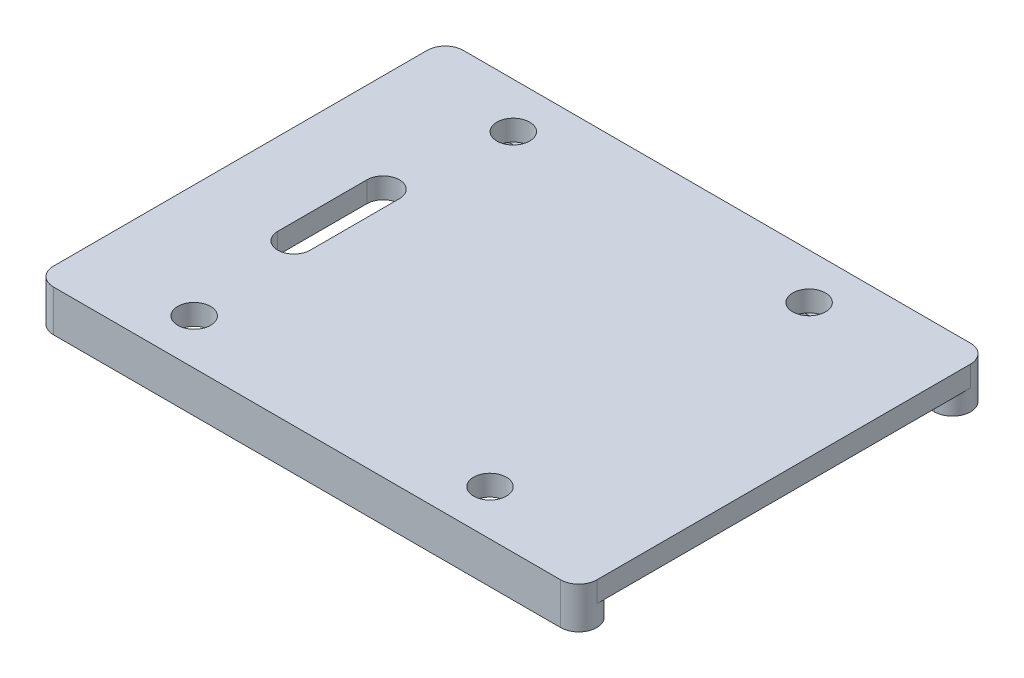
ISO-10303-21;
HEADER;
FILE_DESCRIPTION(('STEP AP214'),'2;1');
FILE_NAME('part.step','',(''),(''),'','','');
FILE_SCHEMA(('AUTOMOTIVE_DESIGN { 1 0 10303 214 1 1 1 1 }'));
ENDSEC;
DATA;
#1=APPLICATION_CONTEXT('core data for automotive mechanical design processes');
#2=APPLICATION_PROTOCOL_DEFINITION('international standard','automotive_design',2000,#1);
#3=PRODUCT_CONTEXT('',#1,'mechanical');
#4=PRODUCT('Part','Part','',(#3));
#5=PRODUCT_RELATED_PRODUCT_CATEGORY('part','',(#4));
#6=PRODUCT_DEFINITION_FORMATION('','',#4);
#7=PRODUCT_DEFINITION_CONTEXT('part definition',#1,'design');
#8=PRODUCT_DEFINITION('design','',#6,#7);
#9=PRODUCT_DEFINITION_SHAPE('','',#8);
#10=(LENGTH_UNIT() NAMED_UNIT(*) SI_UNIT(.MILLI.,.METRE.));
#11=(NAMED_UNIT(*) PLANE_ANGLE_UNIT() SI_UNIT($,.RADIAN.));
#12=(NAMED_UNIT(*) SI_UNIT($,.STERADIAN.) SOLID_ANGLE_UNIT());
#13=UNCERTAINTY_MEASURE_WITH_UNIT(LENGTH_MEASURE(1.E-05),#10,'distance_accuracy_value','');
#14=(GEOMETRIC_REPRESENTATION_CONTEXT(3) GLOBAL_UNCERTAINTY_ASSIGNED_CONTEXT((#13)) GLOBAL_UNIT_ASSIGNED_CONTEXT((#10,
#11,#12)) REPRESENTATION_CONTEXT('',''));
#15=CARTESIAN_POINT('',(0.,0.,0.));
#16=DIRECTION('',(0.,0.,1.));
#17=DIRECTION('',(1.,0.,0.));
#18=AXIS2_PLACEMENT_3D('',#15,#16,#17);
#19=CARTESIAN_POINT('',(-22.9969645109202,-35.5257770331973,-3.90079332186036));
#20=DIRECTION('',(0.,1.,0.));
#21=DIRECTION('',(-1.,0.,0.));
#22=AXIS2_PLACEMENT_3D('',#19,#20,#21);
#23=CYLINDRICAL_SURFACE('',#22,1.74329172099651);
#24=CARTESIAN_POINT('',(-22.9969645109202,17.0764824763644,-3.90079332186036));
#25=DIRECTION('',(0.,1.,0.));
#26=DIRECTION('',(-1.,0.,0.));
#27=AXIS2_PLACEMENT_3D('',#24,#25,#26);
#28=CIRCLE('',#27,1.74329172099651);
#29=CARTESIAN_POINT('',(-22.9969645109202,17.0764824763644,-2.15750160086384));
#30=VERTEX_POINT('',#29);
#31=CARTESIAN_POINT('',(-22.9969645109202,17.0764824763644,-5.64408504285687));
#32=VERTEX_POINT('',#31);
#33=EDGE_CURVE('E47',#30,#32,#28,.F.);
#34=ORIENTED_EDGE('',*,*,#33,.F.);
#35=DIRECTION('',(0.,1.,0.));
#36=VECTOR('',#35,1.);
#37=CARTESIAN_POINT('',(-22.9969645109202,-35.5257770331973,-2.15750160086384));
#38=LINE('',#37,#36);
#39=CARTESIAN_POINT('',(-22.9969645109202,19.0764824763644,-2.15750160086384));
#40=VERTEX_POINT('',#39);
#41=EDGE_CURVE('E311',#30,#40,#38,.T.);
#42=ORIENTED_EDGE('',*,*,#41,.T.);
#43=CARTESIAN_POINT('',(-22.9969645109202,19.0764824763644,-3.90079332186036));
#44=DIRECTION('',(0.,1.,0.));
#45=DIRECTION('',(1.,0.,0.));
#46=AXIS2_PLACEMENT_3D('',#43,#44,#45);
#47=CIRCLE('',#46,1.74329172099651);
#48=CARTESIAN_POINT('',(-24.7402562319167,19.0764824763644,-3.90079332186036));
#49=VERTEX_POINT('',#48);
#50=EDGE_CURVE('E281',#49,#40,#47,.T.);
#51=ORIENTED_EDGE('',*,*,#50,.F.);
#52=DIRECTION('',(0.,-1.,0.));
#53=VECTOR('',#52,1.);
#54=CARTESIAN_POINT('',(-24.7402562319167,21.0764824763644,-3.90079332186036));
#55=LINE('',#54,#53);
#56=CARTESIAN_POINT('',(-24.7402562319167,21.0764824763644,-3.90079332186036));
#57=VERTEX_POINT('',#56);
#58=EDGE_CURVE('E291',#57,#49,#55,.T.);
#59=ORIENTED_EDGE('',*,*,#58,.F.);
#60=CARTESIAN_POINT('',(-22.9969645109202,21.0764824763644,-3.90079332186036));
#61=DIRECTION('',(0.,1.,0.));
#62=DIRECTION('',(-1.,0.,0.));
#63=AXIS2_PLACEMENT_3D('',#60,#61,#62);
#64=CIRCLE('',#63,1.74329172099651);
#65=CARTESIAN_POINT('',(-22.9969645109202,21.0764824763644,-5.64408504285687));
#66=VERTEX_POINT('',#65);
#67=EDGE_CURVE('E233',#66,#57,#64,.T.);
#68=ORIENTED_EDGE('',*,*,#67,.F.);
#69=DIRECTION('',(0.,1.,0.));
#70=VECTOR('',#69,1.);
#71=CARTESIAN_POINT('',(-22.9969645109202,-35.5257770331973,-5.64408504285687));
#72=LINE('',#71,#70);
#73=EDGE_CURVE('E299',#32,#66,#72,.T.);
#74=ORIENTED_EDGE('',*,*,#73,.F.);
#75=EDGE_LOOP('',(#34,#42,#51,#59,#68,#74));
#76=FACE_BOUND('',#75,.T.);
#77=ADVANCED_FACE('F40',(#76),#23,.T.);
#78=CARTESIAN_POINT('',(-22.9969645109202,-35.5257770331973,-5.64408504285687));
#79=DIRECTION('',(0.,0.,-1.));
#80=DIRECTION('',(0.,1.,0.));
#81=AXIS2_PLACEMENT_3D('',#78,#79,#80);
#82=PLANE('',#81);
#83=DIRECTION('',(1.,0.,0.));
#84=VECTOR('',#83,1.);
#85=CARTESIAN_POINT('',(-22.9969645109202,17.0764824763644,-5.64408504285687));
#86=LINE('',#85,#84);
#87=CARTESIAN_POINT('',(26.0030354890798,17.0764824763644,-5.64408504285687));
#88=VERTEX_POINT('',#87);
#89=EDGE_CURVE('E298',#32,#88,#86,.T.);
#90=ORIENTED_EDGE('',*,*,#89,.F.);
#91=ORIENTED_EDGE('',*,*,#73,.T.);
#92=DIRECTION('',(-1.,0.,0.));
#93=VECTOR('',#92,1.);
#94=CARTESIAN_POINT('',(0.,21.0764824763644,-5.64408504285687));
#95=LINE('',#94,#93);
#96=CARTESIAN_POINT('',(26.0030354890798,21.0764824763644,-5.64408504285687));
#97=VERTEX_POINT('',#96);
#98=EDGE_CURVE('E230',#97,#66,#95,.T.);
#99=ORIENTED_EDGE('',*,*,#98,.F.);
#100=DIRECTION('',(0.,1.,0.));
#101=VECTOR('',#100,1.);
#102=CARTESIAN_POINT('',(26.0030354890798,-35.5257770331973,-5.64408504285687));
#103=LINE('',#102,#101);
#104=EDGE_CURVE('E313',#88,#97,#103,.T.);
#105=ORIENTED_EDGE('',*,*,#104,.F.);
#106=EDGE_LOOP('',(#90,#91,#99,#105));
#107=FACE_BOUND('',#106,.T.);
#108=ADVANCED_FACE('F351',(#107),#82,.T.);
#109=CARTESIAN_POINT('',(26.0030354890798,-35.5257770331973,-3.90079332186036));
#110=DIRECTION('',(0.,1.,0.));
#111=DIRECTION('',(-1.,0.,0.));
#112=AXIS2_PLACEMENT_3D('',#109,#110,#111);
#113=CYLINDRICAL_SURFACE('',#112,1.74329172099651);
#114=CARTESIAN_POINT('',(26.0030354890798,17.0764824763644,-3.90079332186036));
#115=DIRECTION('',(0.,1.,0.));
#116=DIRECTION('',(-1.,0.,0.));
#117=AXIS2_PLACEMENT_3D('',#114,#115,#116);
#118=CIRCLE('',#117,1.74329172099651);
#119=CARTESIAN_POINT('',(26.0030354890798,17.0764824763644,-2.15750160086386));
#120=VERTEX_POINT('',#119);
#121=EDGE_CURVE('E296',#88,#120,#118,.F.);
#122=ORIENTED_EDGE('',*,*,#121,.F.);
#123=ORIENTED_EDGE('',*,*,#104,.T.);
#124=CARTESIAN_POINT('',(26.0030354890798,21.0764824763644,-3.90079332186036));
#125=DIRECTION('',(0.,1.,0.));
#126=DIRECTION('',(-1.,0.,0.));
#127=AXIS2_PLACEMENT_3D('',#124,#125,#126);
#128=CIRCLE('',#127,1.74329172099651);
#129=CARTESIAN_POINT('',(27.7463272100763,21.0764824763644,-3.90079332186036));
#130=VERTEX_POINT('',#129);
#131=EDGE_CURVE('E226',#130,#97,#128,.T.);
#132=ORIENTED_EDGE('',*,*,#131,.F.);
#133=DIRECTION('',(0.,-1.,0.));
#134=VECTOR('',#133,1.);
#135=CARTESIAN_POINT('',(27.7463272100763,21.0764824763644,-3.90079332186036));
#136=LINE('',#135,#134);
#137=CARTESIAN_POINT('',(27.7463272100763,19.0764824763644,-3.90079332186036));
#138=VERTEX_POINT('',#137);
#139=EDGE_CURVE('E275',#130,#138,#136,.T.);
#140=ORIENTED_EDGE('',*,*,#139,.T.);
#141=CARTESIAN_POINT('',(26.0030354890798,19.0764824763644,-3.90079332186036));
#142=DIRECTION('',(0.,1.,0.));
#143=DIRECTION('',(1.,0.,0.));
#144=AXIS2_PLACEMENT_3D('',#141,#142,#143);
#145=CIRCLE('',#144,1.74329172099651);
#146=CARTESIAN_POINT('',(26.0030354890798,19.0764824763644,-2.15750160086386));
#147=VERTEX_POINT('',#146);
#148=EDGE_CURVE('E308',#147,#138,#145,.T.);
#149=ORIENTED_EDGE('',*,*,#148,.F.);
#150=DIRECTION('',(0.,1.,0.));
#151=VECTOR('',#150,1.);
#152=CARTESIAN_POINT('',(26.0030354890798,-35.5257770331973,-2.15750160086386));
#153=LINE('',#152,#151);
#154=EDGE_CURVE('E315',#120,#147,#153,.T.);
#155=ORIENTED_EDGE('',*,*,#154,.F.);
#156=EDGE_LOOP('',(#122,#123,#132,#140,#149,#155));
#157=FACE_BOUND('',#156,.T.);
#158=ADVANCED_FACE('F358',(#157),#113,.T.);
#159=CARTESIAN_POINT('',(26.0030354890798,-35.5257770331973,-2.15750160086386));
#160=DIRECTION('',(0.,0.,1.));
#161=DIRECTION('',(1.,0.,0.));
#162=AXIS2_PLACEMENT_3D('',#159,#160,#161);
#163=PLANE('',#162);
#164=DIRECTION('',(-1.,0.,0.));
#165=VECTOR('',#164,1.);
#166=CARTESIAN_POINT('',(26.0030354890798,17.0764824763644,-2.15750160086386));
#167=LINE('',#166,#165);
#168=EDGE_CURVE('E11',#120,#30,#167,.T.);
#169=ORIENTED_EDGE('',*,*,#168,.F.);
#170=ORIENTED_EDGE('',*,*,#154,.T.);
#171=DIRECTION('',(1.,0.,0.));
#172=VECTOR('',#171,1.);
#173=CARTESIAN_POINT('',(26.0030354890798,19.0764824763644,-2.15750160086386));
#174=LINE('',#173,#172);
#175=CARTESIAN_POINT('',(16.1016908515182,19.0764824763644,-2.15750160086386));
#176=VERTEX_POINT('',#175);
#177=EDGE_CURVE('E304',#176,#147,#174,.T.);
#178=ORIENTED_EDGE('',*,*,#177,.F.);
#179=CARTESIAN_POINT('',(13.4793801266414,19.0764824763644,-2.15750160086385));
#180=VERTEX_POINT('',#179);
#181=EDGE_CURVE('E363',#180,#176,#174,.T.);
#182=ORIENTED_EDGE('',*,*,#181,.F.);
#183=CARTESIAN_POINT('',(-12.4733091484818,19.0764824763644,-2.15750160086385));
#184=VERTEX_POINT('',#183);
#185=EDGE_CURVE('E366',#184,#180,#174,.T.);
#186=ORIENTED_EDGE('',*,*,#185,.F.);
#187=CARTESIAN_POINT('',(-15.0956198733586,19.0764824763644,-2.15750160086385));
#188=VERTEX_POINT('',#187);
#189=EDGE_CURVE('E309',#188,#184,#174,.T.);
#190=ORIENTED_EDGE('',*,*,#189,.F.);
#191=EDGE_CURVE('E305',#40,#188,#174,.T.);
#192=ORIENTED_EDGE('',*,*,#191,.F.);
#193=ORIENTED_EDGE('',*,*,#41,.F.);
#194=EDGE_LOOP('',(#169,#170,#178,#182,#186,#190,#192,#193));
#195=FACE_BOUND('',#194,.T.);
#196=ADVANCED_FACE('F326',(#195),#163,.T.);
#197=CARTESIAN_POINT('',(94.2357775993267,17.0764824763644,-11.0499999999999));
#198=DIRECTION('',(0.,1.,0.));
#199=DIRECTION('',(-1.,0.,0.));
#200=AXIS2_PLACEMENT_3D('',#197,#198,#199);
#201=PLANE('',#200);
#202=ORIENTED_EDGE('',*,*,#33,.T.);
#203=ORIENTED_EDGE('',*,*,#89,.T.);
#204=ORIENTED_EDGE('',*,*,#121,.T.);
#205=ORIENTED_EDGE('',*,*,#168,.T.);
#206=EDGE_LOOP('',(#202,#203,#204,#205));
#207=FACE_BOUND('',#206,.T.);
#208=ADVANCED_FACE('F355',(#207),#201,.F.);
#209=CARTESIAN_POINT('',(0.,19.0764824763644,0.));
#210=DIRECTION('',(0.,1.,0.));
#211=DIRECTION('',(-1.,0.,0.));
#212=AXIS2_PLACEMENT_3D('',#209,#210,#211);
#213=PLANE('',#212);
#214=DIRECTION('',(-1.,0.,0.));
#215=VECTOR('',#214,1.);
#216=CARTESIAN_POINT('',(26.0030354890798,19.0764824763644,30.4567082790035));
#217=LINE('',#216,#215);
#218=CARTESIAN_POINT('',(13.4788389526196,19.0764824763644,30.4567082790035));
#219=VERTEX_POINT('',#218);
#220=CARTESIAN_POINT('',(-12.47276797446,19.0764824763644,30.4567082790035));
#221=VERTEX_POINT('',#220);
#222=EDGE_CURVE('E184',#219,#221,#217,.T.);
#223=ORIENTED_EDGE('',*,*,#222,.T.);
#224=CARTESIAN_POINT('',(-13.7844645109202,19.0764824763644,29.5625));
#225=DIRECTION('',(0.,1.,0.));
#226=DIRECTION('',(-1.,0.,0.));
#227=AXIS2_PLACEMENT_3D('',#224,#225,#226);
#228=CIRCLE('',#227,1.5875);
#229=CARTESIAN_POINT('',(-15.0961610473803,19.0764824763644,30.4567082790035));
#230=VERTEX_POINT('',#229);
#231=EDGE_CURVE('E716',#221,#230,#228,.T.);
#232=ORIENTED_EDGE('',*,*,#231,.T.);
#233=CARTESIAN_POINT('',(-22.9969645109202,19.0764824763644,30.4567082790035));
#234=VERTEX_POINT('',#233);
#235=EDGE_CURVE('E205',#230,#234,#217,.T.);
#236=ORIENTED_EDGE('',*,*,#235,.T.);
#237=CARTESIAN_POINT('',(-22.9969645109202,19.0764824763644,32.2000000000001));
#238=DIRECTION('',(0.,1.,0.));
#239=DIRECTION('',(-1.,0.,0.));
#240=AXIS2_PLACEMENT_3D('',#237,#238,#239);
#241=CIRCLE('',#240,1.74329172099651);
#242=CARTESIAN_POINT('',(-24.7402562319167,19.0764824763644,32.2000000000001));
#243=VERTEX_POINT('',#242);
#244=EDGE_CURVE('E209',#234,#243,#241,.T.);
#245=ORIENTED_EDGE('',*,*,#244,.T.);
#246=DIRECTION('',(0.,0.,1.));
#247=VECTOR('',#246,1.);
#248=CARTESIAN_POINT('',(-24.7402562319167,19.0764824763644,0.));
#249=LINE('',#248,#247);
#250=EDGE_CURVE('E258',#49,#243,#249,.T.);
#251=ORIENTED_EDGE('',*,*,#250,.F.);
#252=ORIENTED_EDGE('',*,*,#50,.T.);
#253=ORIENTED_EDGE('',*,*,#191,.T.);
#254=CARTESIAN_POINT('',(-13.7844645109202,19.0764824763644,-1.26249999999993));
#255=DIRECTION('',(0.,1.,0.));
#256=DIRECTION('',(-1.,0.,0.));
#257=AXIS2_PLACEMENT_3D('',#254,#255,#256);
#258=CIRCLE('',#257,1.5875);
#259=EDGE_CURVE('E370',#188,#184,#258,.T.);
#260=ORIENTED_EDGE('',*,*,#259,.T.);
#261=ORIENTED_EDGE('',*,*,#185,.T.);
#262=CARTESIAN_POINT('',(14.7905354890798,19.0764824763644,-1.26249999999992));
#263=DIRECTION('',(0.,1.,0.));
#264=DIRECTION('',(-1.,0.,0.));
#265=AXIS2_PLACEMENT_3D('',#262,#263,#264);
#266=CIRCLE('',#265,1.5875);
#267=EDGE_CURVE('E707',#180,#176,#266,.T.);
#268=ORIENTED_EDGE('',*,*,#267,.T.);
#269=ORIENTED_EDGE('',*,*,#177,.T.);
#270=ORIENTED_EDGE('',*,*,#148,.T.);
#271=DIRECTION('',(0.,0.,1.));
#272=VECTOR('',#271,1.);
#273=CARTESIAN_POINT('',(27.7463272100763,19.0764824763644,0.));
#274=LINE('',#273,#272);
#275=CARTESIAN_POINT('',(27.7463272100763,19.0764824763644,32.2000000000001));
#276=VERTEX_POINT('',#275);
#277=EDGE_CURVE('E212',#138,#276,#274,.T.);
#278=ORIENTED_EDGE('',*,*,#277,.T.);
#279=CARTESIAN_POINT('',(26.0030354890798,19.0764824763644,32.2000000000001));
#280=DIRECTION('',(0.,1.,0.));
#281=DIRECTION('',(-1.,0.,0.));
#282=AXIS2_PLACEMENT_3D('',#279,#280,#281);
#283=CIRCLE('',#282,1.74329172099651);
#284=CARTESIAN_POINT('',(26.0030354890798,19.0764824763644,30.4567082790035));
#285=VERTEX_POINT('',#284);
#286=EDGE_CURVE('E208',#276,#285,#283,.T.);
#287=ORIENTED_EDGE('',*,*,#286,.T.);
#288=CARTESIAN_POINT('',(16.10223202554,19.0764824763644,30.4567082790035));
#289=VERTEX_POINT('',#288);
#290=EDGE_CURVE('E183',#285,#289,#217,.T.);
#291=ORIENTED_EDGE('',*,*,#290,.T.);
#292=CARTESIAN_POINT('',(14.7905354890798,19.0764824763644,29.5625));
#293=DIRECTION('',(0.,1.,0.));
#294=DIRECTION('',(-1.,0.,0.));
#295=AXIS2_PLACEMENT_3D('',#292,#293,#294);
#296=CIRCLE('',#295,1.58750000000005);
#297=EDGE_CURVE('E190',#289,#219,#296,.T.);
#298=ORIENTED_EDGE('',*,*,#297,.T.);
#299=EDGE_LOOP('',(#223,#232,#236,#245,#251,#252,#253,#260,#261,#268,#269,#270,#278,#287,#291,#298));
#300=FACE_BOUND('',#299,.T.);
#301=CARTESIAN_POINT('',(-15.2469645109202,19.0764824763644,9.84000000000006));
#302=DIRECTION('',(0.,1.,0.));
#303=DIRECTION('',(-1.,0.,0.));
#304=AXIS2_PLACEMENT_3D('',#301,#302,#303);
#305=CIRCLE('',#304,1.57420798390938);
#306=CARTESIAN_POINT('',(-13.6727565270109,19.0764824763644,9.84000000000004));
#307=VERTEX_POINT('',#306);
#308=CARTESIAN_POINT('',(-16.8211724948296,19.0764824763644,9.84000000000007));
#309=VERTEX_POINT('',#308);
#310=EDGE_CURVE('E261',#307,#309,#305,.T.);
#311=ORIENTED_EDGE('',*,*,#310,.T.);
#312=DIRECTION('',(0.,0.,1.));
#313=VECTOR('',#312,1.);
#314=CARTESIAN_POINT('',(-16.8211724948297,19.0764824763644,1.42176737639203E-13));
#315=LINE('',#314,#313);
#316=CARTESIAN_POINT('',(-16.8211724948296,19.0764824763644,18.4600000000001));
#317=VERTEX_POINT('',#316);
#318=EDGE_CURVE('E227',#309,#317,#315,.T.);
#319=ORIENTED_EDGE('',*,*,#318,.T.);
#320=CARTESIAN_POINT('',(-15.2469645109202,19.0764824763644,18.4600000000001));
#321=DIRECTION('',(0.,1.,0.));
#322=DIRECTION('',(-1.,0.,0.));
#323=AXIS2_PLACEMENT_3D('',#320,#321,#322);
#324=CIRCLE('',#323,1.57420798390938);
#325=CARTESIAN_POINT('',(-13.6727565270108,19.0764824763644,18.4600000000001));
#326=VERTEX_POINT('',#325);
#327=EDGE_CURVE('E267',#317,#326,#324,.T.);
#328=ORIENTED_EDGE('',*,*,#327,.T.);
#329=DIRECTION('',(0.,0.,-1.));
#330=VECTOR('',#329,1.);
#331=CARTESIAN_POINT('',(-13.6727565270109,19.0764824763644,1.1281398154032E-13));
#332=LINE('',#331,#330);
#333=EDGE_CURVE('E264',#326,#307,#332,.T.);
#334=ORIENTED_EDGE('',*,*,#333,.T.);
#335=EDGE_LOOP('',(#311,#319,#328,#334));
#336=FACE_BOUND('',#335,.T.);
#337=ADVANCED_FACE('F195',(#300,#336),#213,.F.);
#338=CARTESIAN_POINT('',(-15.2469645109202,21.0764824763644,9.84000000000006));
#339=DIRECTION('',(0.,-1.,0.));
#340=DIRECTION('',(1.,0.,0.));
#341=AXIS2_PLACEMENT_3D('',#338,#339,#340);
#342=CYLINDRICAL_SURFACE('',#341,1.57420798390938);
#343=ORIENTED_EDGE('',*,*,#310,.F.);
#344=DIRECTION('',(0.,-1.,0.));
#345=VECTOR('',#344,1.);
#346=CARTESIAN_POINT('',(-13.6727565270109,21.0764824763644,9.84000000000004));
#347=LINE('',#346,#345);
#348=CARTESIAN_POINT('',(-13.6727565270109,21.0764824763644,9.84000000000004));
#349=VERTEX_POINT('',#348);
#350=EDGE_CURVE('E279',#349,#307,#347,.T.);
#351=ORIENTED_EDGE('',*,*,#350,.F.);
#352=CARTESIAN_POINT('',(-15.2469645109202,21.0764824763644,9.84000000000006));
#353=DIRECTION('',(0.,1.,0.));
#354=DIRECTION('',(-1.,0.,0.));
#355=AXIS2_PLACEMENT_3D('',#352,#353,#354);
#356=CIRCLE('',#355,1.57420798390938);
#357=CARTESIAN_POINT('',(-16.8211724948296,21.0764824763644,9.84000000000007));
#358=VERTEX_POINT('',#357);
#359=EDGE_CURVE('E243',#349,#358,#356,.T.);
#360=ORIENTED_EDGE('',*,*,#359,.T.);
#361=DIRECTION('',(0.,-1.,0.));
#362=VECTOR('',#361,1.);
#363=CARTESIAN_POINT('',(-16.8211724948296,21.0764824763644,9.84000000000007));
#364=LINE('',#363,#362);
#365=EDGE_CURVE('E272',#358,#309,#364,.T.);
#366=ORIENTED_EDGE('',*,*,#365,.T.);
#367=EDGE_LOOP('',(#343,#351,#360,#366));
#368=FACE_BOUND('',#367,.T.);
#369=ADVANCED_FACE('F425',(#368),#342,.F.);
#370=CARTESIAN_POINT('',(-13.6727565270109,21.0764824763644,1.12841737115936E-13));
#371=DIRECTION('',(-1.,0.,0.));
#372=DIRECTION('',(0.,0.,1.));
#373=AXIS2_PLACEMENT_3D('',#370,#371,#372);
#374=PLANE('',#373);
#375=ORIENTED_EDGE('',*,*,#333,.F.);
#376=DIRECTION('',(0.,-1.,0.));
#377=VECTOR('',#376,1.);
#378=CARTESIAN_POINT('',(-13.6727565270108,21.0764824763644,18.4600000000001));
#379=LINE('',#378,#377);
#380=CARTESIAN_POINT('',(-13.6727565270108,21.0764824763644,18.4600000000001));
#381=VERTEX_POINT('',#380);
#382=EDGE_CURVE('E277',#381,#326,#379,.T.);
#383=ORIENTED_EDGE('',*,*,#382,.F.);
#384=DIRECTION('',(0.,0.,-1.));
#385=VECTOR('',#384,1.);
#386=CARTESIAN_POINT('',(-13.6727565270109,21.0764824763644,1.12841737115936E-13));
#387=LINE('',#386,#385);
#388=EDGE_CURVE('E246',#381,#349,#387,.T.);
#389=ORIENTED_EDGE('',*,*,#388,.T.);
#390=ORIENTED_EDGE('',*,*,#350,.T.);
#391=EDGE_LOOP('',(#375,#383,#389,#390));
#392=FACE_BOUND('',#391,.T.);
#393=ADVANCED_FACE('F405',(#392),#374,.T.);
#394=CARTESIAN_POINT('',(-15.2469645109202,21.0764824763644,18.4600000000001));
#395=DIRECTION('',(0.,-1.,0.));
#396=DIRECTION('',(1.,0.,0.));
#397=AXIS2_PLACEMENT_3D('',#394,#395,#396);
#398=CYLINDRICAL_SURFACE('',#397,1.57420798390938);
#399=ORIENTED_EDGE('',*,*,#327,.F.);
#400=DIRECTION('',(0.,-1.,0.));
#401=VECTOR('',#400,1.);
#402=CARTESIAN_POINT('',(-16.8211724948296,21.0764824763644,18.4600000000001));
#403=LINE('',#402,#401);
#404=CARTESIAN_POINT('',(-16.8211724948296,21.0764824763644,18.4600000000001));
#405=VERTEX_POINT('',#404);
#406=EDGE_CURVE('E274',#405,#317,#403,.T.);
#407=ORIENTED_EDGE('',*,*,#406,.F.);
#408=CARTESIAN_POINT('',(-15.2469645109202,21.0764824763644,18.4600000000001));
#409=DIRECTION('',(0.,1.,0.));
#410=DIRECTION('',(-1.,0.,0.));
#411=AXIS2_PLACEMENT_3D('',#408,#409,#410);
#412=CIRCLE('',#411,1.57420798390938);
#413=EDGE_CURVE('E249',#405,#381,#412,.T.);
#414=ORIENTED_EDGE('',*,*,#413,.T.);
#415=ORIENTED_EDGE('',*,*,#382,.T.);
#416=EDGE_LOOP('',(#399,#407,#414,#415));
#417=FACE_BOUND('',#416,.T.);
#418=ADVANCED_FACE('F398',(#417),#398,.F.);
#419=CARTESIAN_POINT('',(27.7463272100763,21.0764824763644,0.));
#420=DIRECTION('',(1.,0.,0.));
#421=DIRECTION('',(0.,1.,0.));
#422=AXIS2_PLACEMENT_3D('',#419,#420,#421);
#423=PLANE('',#422);
#424=ORIENTED_EDGE('',*,*,#277,.F.);
#425=ORIENTED_EDGE('',*,*,#139,.F.);
#426=DIRECTION('',(0.,0.,1.));
#427=VECTOR('',#426,1.);
#428=CARTESIAN_POINT('',(27.7463272100763,21.0764824763644,0.));
#429=LINE('',#428,#427);
#430=CARTESIAN_POINT('',(27.7463272100763,21.0764824763644,32.2000000000001));
#431=VERTEX_POINT('',#430);
#432=EDGE_CURVE('E223',#130,#431,#429,.T.);
#433=ORIENTED_EDGE('',*,*,#432,.T.);
#434=DIRECTION('',(0.,-1.,0.));
#435=VECTOR('',#434,1.);
#436=CARTESIAN_POINT('',(27.7463272100763,21.0764824763644,32.2000000000001));
#437=LINE('',#436,#435);
#438=EDGE_CURVE('E255',#431,#276,#437,.T.);
#439=ORIENTED_EDGE('',*,*,#438,.T.);
#440=EDGE_LOOP('',(#424,#425,#433,#439));
#441=FACE_BOUND('',#440,.T.);
#442=ADVANCED_FACE('F396',(#441),#423,.T.);
#443=CARTESIAN_POINT('',(-24.7402562319167,21.0764824763644,0.));
#444=DIRECTION('',(1.,0.,0.));
#445=DIRECTION('',(0.,1.,0.));
#446=AXIS2_PLACEMENT_3D('',#443,#444,#445);
#447=PLANE('',#446);
#448=ORIENTED_EDGE('',*,*,#250,.T.);
#449=DIRECTION('',(0.,-1.,0.));
#450=VECTOR('',#449,1.);
#451=CARTESIAN_POINT('',(-24.7402562319167,21.0764824763644,32.2000000000001));
#452=LINE('',#451,#450);
#453=CARTESIAN_POINT('',(-24.7402562319167,21.0764824763644,32.2000000000001));
#454=VERTEX_POINT('',#453);
#455=EDGE_CURVE('E288',#454,#243,#452,.T.);
#456=ORIENTED_EDGE('',*,*,#455,.F.);
#457=DIRECTION('',(0.,0.,1.));
#458=VECTOR('',#457,1.);
#459=CARTESIAN_POINT('',(-24.7402562319167,21.0764824763644,0.));
#460=LINE('',#459,#458);
#461=EDGE_CURVE('E235',#57,#454,#460,.T.);
#462=ORIENTED_EDGE('',*,*,#461,.F.);
#463=ORIENTED_EDGE('',*,*,#58,.T.);
#464=EDGE_LOOP('',(#448,#456,#462,#463));
#465=FACE_BOUND('',#464,.T.);
#466=ADVANCED_FACE('F333',(#465),#447,.F.);
#467=CARTESIAN_POINT('',(-22.9969645109202,21.0764824763644,32.2000000000001));
#468=DIRECTION('',(0.,-1.,0.));
#469=DIRECTION('',(1.,0.,0.));
#470=AXIS2_PLACEMENT_3D('',#467,#468,#469);
#471=CYLINDRICAL_SURFACE('',#470,1.74329172099651);
#472=ORIENTED_EDGE('',*,*,#455,.T.);
#473=ORIENTED_EDGE('',*,*,#244,.F.);
#474=DIRECTION('',(0.,1.,0.));
#475=VECTOR('',#474,1.);
#476=CARTESIAN_POINT('',(-22.9969645109202,-35.5257770331973,30.4567082790035));
#477=LINE('',#476,#475);
#478=CARTESIAN_POINT('',(-22.9969645109202,17.0764824763644,30.4567082790035));
#479=VERTEX_POINT('',#478);
#480=EDGE_CURVE('E222',#479,#234,#477,.T.);
#481=ORIENTED_EDGE('',*,*,#480,.F.);
#482=CARTESIAN_POINT('',(-22.9969645109202,17.0764824763644,32.2000000000001));
#483=DIRECTION('',(0.,1.,0.));
#484=DIRECTION('',(-1.,0.,0.));
#485=AXIS2_PLACEMENT_3D('',#482,#483,#484);
#486=CIRCLE('',#485,1.74329172099651);
#487=CARTESIAN_POINT('',(-22.9969645109202,17.0764824763644,33.9432917209966));
#488=VERTEX_POINT('',#487);
#489=EDGE_CURVE('E220',#488,#479,#486,.F.);
#490=ORIENTED_EDGE('',*,*,#489,.F.);
#491=DIRECTION('',(0.,-1.,0.));
#492=VECTOR('',#491,1.);
#493=CARTESIAN_POINT('',(-22.9969645109202,21.0764824763644,33.9432917209966));
#494=LINE('',#493,#492);
#495=CARTESIAN_POINT('',(-22.9969645109202,21.0764824763644,33.9432917209966));
#496=VERTEX_POINT('',#495);
#497=EDGE_CURVE('E286',#496,#488,#494,.T.);
#498=ORIENTED_EDGE('',*,*,#497,.F.);
#499=CARTESIAN_POINT('',(-22.9969645109202,21.0764824763644,32.2000000000001));
#500=DIRECTION('',(0.,1.,0.));
#501=DIRECTION('',(-1.,0.,0.));
#502=AXIS2_PLACEMENT_3D('',#499,#500,#501);
#503=CIRCLE('',#502,1.74329172099651);
#504=EDGE_CURVE('E237',#454,#496,#503,.T.);
#505=ORIENTED_EDGE('',*,*,#504,.F.);
#506=EDGE_LOOP('',(#472,#473,#481,#490,#498,#505));
#507=FACE_BOUND('',#506,.T.);
#508=ADVANCED_FACE('F337',(#507),#471,.T.);
#509=CARTESIAN_POINT('',(0.,21.0764824763644,33.9432917209966));
#510=DIRECTION('',(0.,0.,-1.));
#511=DIRECTION('',(-1.,0.,0.));
#512=AXIS2_PLACEMENT_3D('',#509,#510,#511);
#513=PLANE('',#512);
#514=ORIENTED_EDGE('',*,*,#497,.T.);
#515=DIRECTION('',(-1.,0.,0.));
#516=VECTOR('',#515,1.);
#517=CARTESIAN_POINT('',(-22.9969645109202,17.0764824763644,33.9432917209966));
#518=LINE('',#517,#516);
#519=CARTESIAN_POINT('',(26.0030354890798,17.0764824763644,33.9432917209966));
#520=VERTEX_POINT('',#519);
#521=EDGE_CURVE('E216',#520,#488,#518,.T.);
#522=ORIENTED_EDGE('',*,*,#521,.F.);
#523=DIRECTION('',(0.,-1.,0.));
#524=VECTOR('',#523,1.);
#525=CARTESIAN_POINT('',(26.0030354890798,21.0764824763644,33.9432917209966));
#526=LINE('',#525,#524);
#527=CARTESIAN_POINT('',(26.0030354890798,21.0764824763644,33.9432917209966));
#528=VERTEX_POINT('',#527);
#529=EDGE_CURVE('E284',#528,#520,#526,.T.);
#530=ORIENTED_EDGE('',*,*,#529,.F.);
#531=DIRECTION('',(1.,0.,0.));
#532=VECTOR('',#531,1.);
#533=CARTESIAN_POINT('',(0.,21.0764824763644,33.9432917209966));
#534=LINE('',#533,#532);
#535=EDGE_CURVE('E239',#496,#528,#534,.T.);
#536=ORIENTED_EDGE('',*,*,#535,.F.);
#537=EDGE_LOOP('',(#514,#522,#530,#536));
#538=FACE_BOUND('',#537,.T.);
#539=ADVANCED_FACE('F389',(#538),#513,.F.);
#540=CARTESIAN_POINT('',(26.0030354890798,21.0764824763644,32.2000000000001));
#541=DIRECTION('',(0.,-1.,0.));
#542=DIRECTION('',(1.,0.,0.));
#543=AXIS2_PLACEMENT_3D('',#540,#541,#542);
#544=CYLINDRICAL_SURFACE('',#543,1.74329172099651);
#545=ORIENTED_EDGE('',*,*,#529,.T.);
#546=CARTESIAN_POINT('',(26.0030354890798,17.0764824763644,32.2000000000001));
#547=DIRECTION('',(0.,1.,0.));
#548=DIRECTION('',(-1.,0.,0.));
#549=AXIS2_PLACEMENT_3D('',#546,#547,#548);
#550=CIRCLE('',#549,1.74329172099651);
#551=CARTESIAN_POINT('',(26.0030354890798,17.0764824763644,30.4567082790035));
#552=VERTEX_POINT('',#551);
#553=EDGE_CURVE('E213',#552,#520,#550,.F.);
#554=ORIENTED_EDGE('',*,*,#553,.F.);
#555=DIRECTION('',(0.,1.,0.));
#556=VECTOR('',#555,1.);
#557=CARTESIAN_POINT('',(26.0030354890798,-35.5257770331973,30.4567082790035));
#558=LINE('',#557,#556);
#559=EDGE_CURVE('E381',#552,#285,#558,.T.);
#560=ORIENTED_EDGE('',*,*,#559,.T.);
#561=ORIENTED_EDGE('',*,*,#286,.F.);
#562=ORIENTED_EDGE('',*,*,#438,.F.);
#563=CARTESIAN_POINT('',(26.0030354890798,21.0764824763644,32.2000000000001));
#564=DIRECTION('',(0.,1.,0.));
#565=DIRECTION('',(-1.,0.,0.));
#566=AXIS2_PLACEMENT_3D('',#563,#564,#565);
#567=CIRCLE('',#566,1.74329172099651);
#568=EDGE_CURVE('E241',#528,#431,#567,.T.);
#569=ORIENTED_EDGE('',*,*,#568,.F.);
#570=EDGE_LOOP('',(#545,#554,#560,#561,#562,#569));
#571=FACE_BOUND('',#570,.T.);
#572=ADVANCED_FACE('F393',(#571),#544,.T.);
#573=CARTESIAN_POINT('',(-16.8211724948297,21.0764824763644,1.42204493214819E-13));
#574=DIRECTION('',(1.,0.,0.));
#575=DIRECTION('',(0.,0.,-1.));
#576=AXIS2_PLACEMENT_3D('',#573,#574,#575);
#577=PLANE('',#576);
#578=ORIENTED_EDGE('',*,*,#318,.F.);
#579=ORIENTED_EDGE('',*,*,#365,.F.);
#580=DIRECTION('',(0.,0.,1.));
#581=VECTOR('',#580,1.);
#582=CARTESIAN_POINT('',(-16.8211724948297,21.0764824763644,1.42204493214819E-13));
#583=LINE('',#582,#581);
#584=EDGE_CURVE('E252',#358,#405,#583,.T.);
#585=ORIENTED_EDGE('',*,*,#584,.T.);
#586=ORIENTED_EDGE('',*,*,#406,.T.);
#587=EDGE_LOOP('',(#578,#579,#585,#586));
#588=FACE_BOUND('',#587,.T.);
#589=ADVANCED_FACE('F435',(#588),#577,.T.);
#590=CARTESIAN_POINT('',(0.,21.0764824763644,0.));
#591=DIRECTION('',(0.,1.,0.));
#592=DIRECTION('',(-1.,0.,0.));
#593=AXIS2_PLACEMENT_3D('',#590,#591,#592);
#594=PLANE('',#593);
#595=CARTESIAN_POINT('',(-13.7844645109202,21.0764824763644,29.5625));
#596=DIRECTION('',(0.,1.,0.));
#597=DIRECTION('',(-1.,0.,0.));
#598=AXIS2_PLACEMENT_3D('',#595,#596,#597);
#599=CIRCLE('',#598,1.5875);
#600=CARTESIAN_POINT('',(-15.3719645109202,21.0764824763644,29.5625));
#601=VERTEX_POINT('',#600);
#602=EDGE_CURVE('E199',#601,#601,#599,.T.);
#603=ORIENTED_EDGE('',*,*,#602,.F.);
#604=EDGE_LOOP('',(#603));
#605=FACE_BOUND('',#604,.T.);
#606=CARTESIAN_POINT('',(14.7905354890798,21.0764824763644,29.5625));
#607=DIRECTION('',(0.,1.,0.));
#608=DIRECTION('',(-1.,0.,0.));
#609=AXIS2_PLACEMENT_3D('',#606,#607,#608);
#610=CIRCLE('',#609,1.58750000000005);
#611=CARTESIAN_POINT('',(13.2030354890798,21.0764824763644,29.5625));
#612=VERTEX_POINT('',#611);
#613=EDGE_CURVE('E191',#612,#612,#610,.T.);
#614=ORIENTED_EDGE('',*,*,#613,.F.);
#615=EDGE_LOOP('',(#614));
#616=FACE_BOUND('',#615,.T.);
#617=CARTESIAN_POINT('',(14.7905354890798,21.0764824763644,-1.26249999999992));
#618=DIRECTION('',(0.,1.,0.));
#619=DIRECTION('',(-1.,0.,0.));
#620=AXIS2_PLACEMENT_3D('',#617,#618,#619);
#621=CIRCLE('',#620,1.5875);
#622=CARTESIAN_POINT('',(13.2030354890798,21.0764824763644,-1.26249999999992));
#623=VERTEX_POINT('',#622);
#624=EDGE_CURVE('E374',#623,#623,#621,.T.);
#625=ORIENTED_EDGE('',*,*,#624,.F.);
#626=EDGE_LOOP('',(#625));
#627=FACE_BOUND('',#626,.T.);
#628=CARTESIAN_POINT('',(-13.7844645109202,21.0764824763644,-1.26249999999993));
#629=DIRECTION('',(0.,1.,0.));
#630=DIRECTION('',(-1.,0.,0.));
#631=AXIS2_PLACEMENT_3D('',#628,#629,#630);
#632=CIRCLE('',#631,1.5875);
#633=CARTESIAN_POINT('',(-15.3719645109202,21.0764824763644,-1.26249999999993));
#634=VERTEX_POINT('',#633);
#635=EDGE_CURVE('E371',#634,#634,#632,.T.);
#636=ORIENTED_EDGE('',*,*,#635,.F.);
#637=EDGE_LOOP('',(#636));
#638=FACE_BOUND('',#637,.T.);
#639=ORIENTED_EDGE('',*,*,#432,.F.);
#640=ORIENTED_EDGE('',*,*,#131,.T.);
#641=ORIENTED_EDGE('',*,*,#98,.T.);
#642=ORIENTED_EDGE('',*,*,#67,.T.);
#643=ORIENTED_EDGE('',*,*,#461,.T.);
#644=ORIENTED_EDGE('',*,*,#504,.T.);
#645=ORIENTED_EDGE('',*,*,#535,.T.);
#646=ORIENTED_EDGE('',*,*,#568,.T.);
#647=EDGE_LOOP('',(#639,#640,#641,#642,#643,#644,#645,#646));
#648=FACE_BOUND('',#647,.T.);
#649=ORIENTED_EDGE('',*,*,#359,.F.);
#650=ORIENTED_EDGE('',*,*,#388,.F.);
#651=ORIENTED_EDGE('',*,*,#413,.F.);
#652=ORIENTED_EDGE('',*,*,#584,.F.);
#653=EDGE_LOOP('',(#649,#650,#651,#652));
#654=FACE_BOUND('',#653,.T.);
#655=ADVANCED_FACE('F344',(#605,#616,#627,#638,#648,#654),#594,.T.);
#656=CARTESIAN_POINT('',(26.0030354890798,-35.5257770331973,30.4567082790035));
#657=DIRECTION('',(0.,0.,-1.));
#658=DIRECTION('',(0.,1.,0.));
#659=AXIS2_PLACEMENT_3D('',#656,#657,#658);
#660=PLANE('',#659);
#661=DIRECTION('',(1.,0.,0.));
#662=VECTOR('',#661,1.);
#663=CARTESIAN_POINT('',(26.0030354890798,17.0764824763644,30.4567082790035));
#664=LINE('',#663,#662);
#665=EDGE_CURVE('E217',#479,#552,#664,.T.);
#666=ORIENTED_EDGE('',*,*,#665,.F.);
#667=ORIENTED_EDGE('',*,*,#480,.T.);
#668=ORIENTED_EDGE('',*,*,#235,.F.);
#669=EDGE_CURVE('E204',#221,#230,#217,.T.);
#670=ORIENTED_EDGE('',*,*,#669,.F.);
#671=ORIENTED_EDGE('',*,*,#222,.F.);
#672=EDGE_CURVE('E174',#289,#219,#217,.T.);
#673=ORIENTED_EDGE('',*,*,#672,.F.);
#674=ORIENTED_EDGE('',*,*,#290,.F.);
#675=ORIENTED_EDGE('',*,*,#559,.F.);
#676=EDGE_LOOP('',(#666,#667,#668,#670,#671,#673,#674,#675));
#677=FACE_BOUND('',#676,.T.);
#678=ADVANCED_FACE('F202',(#677),#660,.T.);
#679=CARTESIAN_POINT('',(94.2357775993267,17.0764824763644,-11.0499999999999));
#680=DIRECTION('',(0.,1.,0.));
#681=DIRECTION('',(-1.,0.,0.));
#682=AXIS2_PLACEMENT_3D('',#679,#680,#681);
#683=PLANE('',#682);
#684=ORIENTED_EDGE('',*,*,#553,.T.);
#685=ORIENTED_EDGE('',*,*,#521,.T.);
#686=ORIENTED_EDGE('',*,*,#489,.T.);
#687=ORIENTED_EDGE('',*,*,#665,.T.);
#688=EDGE_LOOP('',(#684,#685,#686,#687));
#689=FACE_BOUND('',#688,.T.);
#690=ADVANCED_FACE('F385',(#689),#683,.F.);
#691=CARTESIAN_POINT('',(14.7905354890798,19.0764824763644,29.5625));
#692=DIRECTION('',(0.,1.,0.));
#693=DIRECTION('',(-1.,0.,0.));
#694=AXIS2_PLACEMENT_3D('',#691,#692,#693);
#695=CYLINDRICAL_SURFACE('',#694,1.58750000000005);
#696=EDGE_CURVE('E177',#219,#289,#296,.T.);
#697=ORIENTED_EDGE('',*,*,#696,.F.);
#698=ORIENTED_EDGE('',*,*,#297,.F.);
#699=EDGE_LOOP('',(#697,#698));
#700=FACE_BOUND('',#699,.T.);
#701=ORIENTED_EDGE('',*,*,#613,.T.);
#702=EDGE_LOOP('',(#701));
#703=FACE_BOUND('',#702,.T.);
#704=ADVANCED_FACE('F188',(#700,#703),#695,.F.);
#705=CARTESIAN_POINT('',(14.7905354890798,19.0764824763644,29.5625));
#706=DIRECTION('',(0.,1.,0.));
#707=DIRECTION('',(-1.,0.,0.));
#708=AXIS2_PLACEMENT_3D('',#705,#706,#707);
#709=PLANE('',#708);
#710=ORIENTED_EDGE('',*,*,#696,.T.);
#711=ORIENTED_EDGE('',*,*,#672,.T.);
#712=EDGE_LOOP('',(#710,#711));
#713=FACE_BOUND('',#712,.T.);
#714=ADVANCED_FACE('F176',(#713),#709,.T.);
#715=CARTESIAN_POINT('',(-13.7844645109202,19.0764824763644,29.5625));
#716=DIRECTION('',(0.,1.,0.));
#717=DIRECTION('',(-1.,0.,0.));
#718=AXIS2_PLACEMENT_3D('',#715,#716,#717);
#719=CYLINDRICAL_SURFACE('',#718,1.5875);
#720=EDGE_CURVE('E377',#230,#221,#228,.T.);
#721=ORIENTED_EDGE('',*,*,#720,.F.);
#722=ORIENTED_EDGE('',*,*,#231,.F.);
#723=EDGE_LOOP('',(#721,#722));
#724=FACE_BOUND('',#723,.T.);
#725=ORIENTED_EDGE('',*,*,#602,.T.);
#726=EDGE_LOOP('',(#725));
#727=FACE_BOUND('',#726,.T.);
#728=ADVANCED_FACE('F492',(#724,#727),#719,.F.);
#729=CARTESIAN_POINT('',(-13.7844645109202,19.0764824763644,29.5625));
#730=DIRECTION('',(0.,1.,0.));
#731=DIRECTION('',(-1.,0.,0.));
#732=AXIS2_PLACEMENT_3D('',#729,#730,#731);
#733=PLANE('',#732);
#734=ORIENTED_EDGE('',*,*,#720,.T.);
#735=ORIENTED_EDGE('',*,*,#669,.T.);
#736=EDGE_LOOP('',(#734,#735));
#737=FACE_BOUND('',#736,.T.);
#738=ADVANCED_FACE('F499',(#737),#733,.T.);
#739=CARTESIAN_POINT('',(-13.7844645109202,19.0764824763644,-1.26249999999993));
#740=DIRECTION('',(0.,1.,0.));
#741=DIRECTION('',(-1.,0.,0.));
#742=AXIS2_PLACEMENT_3D('',#739,#740,#741);
#743=CYLINDRICAL_SURFACE('',#742,1.5875);
#744=EDGE_CURVE('E60',#184,#188,#258,.T.);
#745=ORIENTED_EDGE('',*,*,#744,.F.);
#746=ORIENTED_EDGE('',*,*,#259,.F.);
#747=EDGE_LOOP('',(#745,#746));
#748=FACE_BOUND('',#747,.T.);
#749=ORIENTED_EDGE('',*,*,#635,.T.);
#750=EDGE_LOOP('',(#749));
#751=FACE_BOUND('',#750,.T.);
#752=ADVANCED_FACE('F507',(#748,#751),#743,.F.);
#753=CARTESIAN_POINT('',(-13.7844645109202,19.0764824763644,-1.26249999999993));
#754=DIRECTION('',(0.,1.,0.));
#755=DIRECTION('',(-1.,0.,0.));
#756=AXIS2_PLACEMENT_3D('',#753,#754,#755);
#757=PLANE('',#756);
#758=ORIENTED_EDGE('',*,*,#744,.T.);
#759=ORIENTED_EDGE('',*,*,#189,.T.);
#760=EDGE_LOOP('',(#758,#759));
#761=FACE_BOUND('',#760,.T.);
#762=ADVANCED_FACE('F369',(#761),#757,.T.);
#763=CARTESIAN_POINT('',(14.7905354890798,19.0764824763644,-1.26249999999992));
#764=DIRECTION('',(0.,1.,0.));
#765=DIRECTION('',(-1.,0.,0.));
#766=AXIS2_PLACEMENT_3D('',#763,#764,#765);
#767=CYLINDRICAL_SURFACE('',#766,1.5875);
#768=EDGE_CURVE('E53',#176,#180,#266,.T.);
#769=ORIENTED_EDGE('',*,*,#768,.F.);
#770=ORIENTED_EDGE('',*,*,#267,.F.);
#771=EDGE_LOOP('',(#769,#770));
#772=FACE_BOUND('',#771,.T.);
#773=ORIENTED_EDGE('',*,*,#624,.T.);
#774=EDGE_LOOP('',(#773));
#775=FACE_BOUND('',#774,.T.);
#776=ADVANCED_FACE('F521',(#772,#775),#767,.F.);
#777=CARTESIAN_POINT('',(14.7905354890798,19.0764824763644,-1.26249999999992));
#778=DIRECTION('',(0.,1.,0.));
#779=DIRECTION('',(-1.,0.,0.));
#780=AXIS2_PLACEMENT_3D('',#777,#778,#779);
#781=PLANE('',#780);
#782=ORIENTED_EDGE('',*,*,#768,.T.);
#783=ORIENTED_EDGE('',*,*,#181,.T.);
#784=EDGE_LOOP('',(#782,#783));
#785=FACE_BOUND('',#784,.T.);
#786=ADVANCED_FACE('F528',(#785),#781,.T.);
#787=CLOSED_SHELL('',(#77,#108,#158,#196,#208,#337,#369,#393,#418,#442,#466,#508,#539,#572,#589,
#655,#678,#690,#704,#714,#728,#738,#752,#762,#776,#786));
#788=MANIFOLD_SOLID_BREP('B2',#787);
#789=ADVANCED_BREP_SHAPE_REPRESENTATION('',(#18,#788),#14);
#790=SHAPE_DEFINITION_REPRESENTATION(#9,#789);
ENDSEC;
END-ISO-10303-21;
